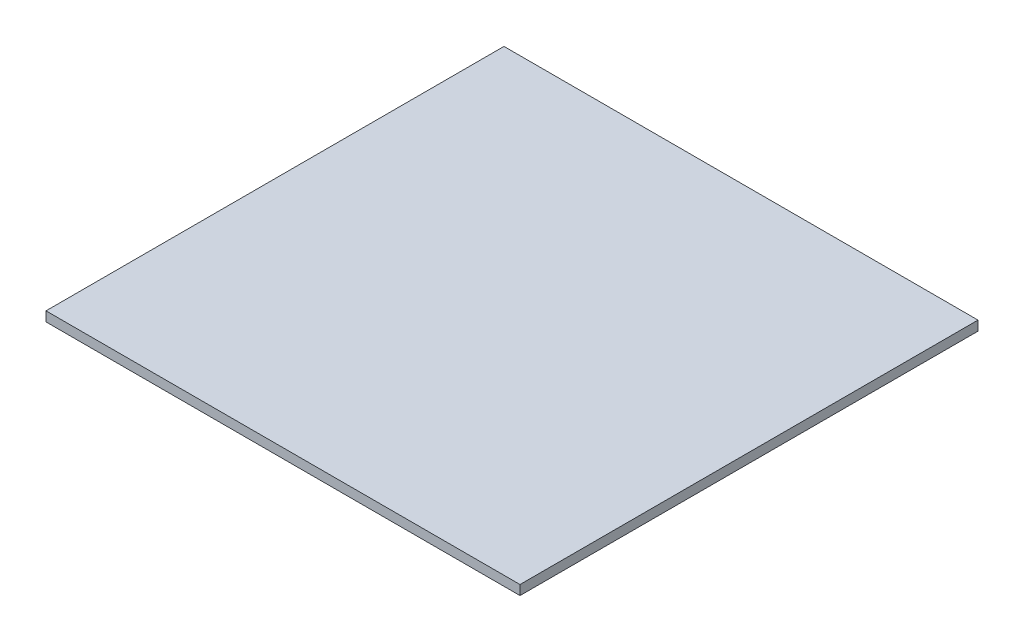
ISO-10303-21;
HEADER;
FILE_DESCRIPTION(('STEP AP214'),'2;1');
FILE_NAME('part.step','',(''),(''),'','','');
FILE_SCHEMA(('AUTOMOTIVE_DESIGN { 1 0 10303 214 1 1 1 1 }'));
ENDSEC;
DATA;
#1=APPLICATION_CONTEXT('core data for automotive mechanical design processes');
#2=APPLICATION_PROTOCOL_DEFINITION('international standard','automotive_design',2000,#1);
#3=PRODUCT_CONTEXT('',#1,'mechanical');
#4=PRODUCT('Part','Part','',(#3));
#5=PRODUCT_RELATED_PRODUCT_CATEGORY('part','',(#4));
#6=PRODUCT_DEFINITION_FORMATION('','',#4);
#7=PRODUCT_DEFINITION_CONTEXT('part definition',#1,'design');
#8=PRODUCT_DEFINITION('design','',#6,#7);
#9=PRODUCT_DEFINITION_SHAPE('','',#8);
#10=(LENGTH_UNIT() NAMED_UNIT(*) SI_UNIT(.MILLI.,.METRE.));
#11=(NAMED_UNIT(*) PLANE_ANGLE_UNIT() SI_UNIT($,.RADIAN.));
#12=(NAMED_UNIT(*) SI_UNIT($,.STERADIAN.) SOLID_ANGLE_UNIT());
#13=UNCERTAINTY_MEASURE_WITH_UNIT(LENGTH_MEASURE(1.E-05),#10,'distance_accuracy_value','');
#14=(GEOMETRIC_REPRESENTATION_CONTEXT(3) GLOBAL_UNCERTAINTY_ASSIGNED_CONTEXT((#13)) GLOBAL_UNIT_ASSIGNED_CONTEXT((#10,
#11,#12)) REPRESENTATION_CONTEXT('',''));
#15=CARTESIAN_POINT('',(0.,0.,0.));
#16=DIRECTION('',(0.,0.,1.));
#17=DIRECTION('',(1.,0.,0.));
#18=AXIS2_PLACEMENT_3D('',#15,#16,#17);
#19=CARTESIAN_POINT('',(469.9,19.05,454.025));
#20=DIRECTION('',(-1.,0.,0.));
#21=DIRECTION('',(0.,0.,1.));
#22=AXIS2_PLACEMENT_3D('',#19,#20,#21);
#23=PLANE('',#22);
#24=DIRECTION('',(0.,0.,-1.));
#25=VECTOR('',#24,1.);
#26=CARTESIAN_POINT('',(469.9,0.,454.025));
#27=LINE('',#26,#25);
#28=CARTESIAN_POINT('',(469.9,0.,454.025));
#29=VERTEX_POINT('',#28);
#30=CARTESIAN_POINT('',(469.9,0.,-454.025));
#31=VERTEX_POINT('',#30);
#32=EDGE_CURVE('E98',#29,#31,#27,.T.);
#33=ORIENTED_EDGE('',*,*,#32,.T.);
#34=DIRECTION('',(0.,-1.,0.));
#35=VECTOR('',#34,1.);
#36=CARTESIAN_POINT('',(469.9,19.05,-454.025));
#37=LINE('',#36,#35);
#38=CARTESIAN_POINT('',(469.9,19.05,-454.025));
#39=VERTEX_POINT('',#38);
#40=EDGE_CURVE('E11',#39,#31,#37,.T.);
#41=ORIENTED_EDGE('',*,*,#40,.F.);
#42=DIRECTION('',(0.,0.,-1.));
#43=VECTOR('',#42,1.);
#44=CARTESIAN_POINT('',(469.9,19.05,454.025));
#45=LINE('',#44,#43);
#46=CARTESIAN_POINT('',(469.9,19.05,454.025));
#47=VERTEX_POINT('',#46);
#48=EDGE_CURVE('E86',#47,#39,#45,.T.);
#49=ORIENTED_EDGE('',*,*,#48,.F.);
#50=DIRECTION('',(0.,-1.,0.));
#51=VECTOR('',#50,1.);
#52=CARTESIAN_POINT('',(469.9,19.05,454.025));
#53=LINE('',#52,#51);
#54=EDGE_CURVE('E94',#47,#29,#53,.T.);
#55=ORIENTED_EDGE('',*,*,#54,.T.);
#56=EDGE_LOOP('',(#33,#41,#49,#55));
#57=FACE_BOUND('',#56,.T.);
#58=ADVANCED_FACE('F35',(#57),#23,.F.);
#59=CARTESIAN_POINT('',(-469.9,19.05,-454.025));
#60=DIRECTION('',(0.,0.,1.));
#61=DIRECTION('',(1.,0.,0.));
#62=AXIS2_PLACEMENT_3D('',#59,#60,#61);
#63=PLANE('',#62);
#64=DIRECTION('',(-1.,0.,0.));
#65=VECTOR('',#64,1.);
#66=CARTESIAN_POINT('',(-469.9,0.,-454.025));
#67=LINE('',#66,#65);
#68=CARTESIAN_POINT('',(-469.9,0.,-454.025));
#69=VERTEX_POINT('',#68);
#70=EDGE_CURVE('E90',#31,#69,#67,.T.);
#71=ORIENTED_EDGE('',*,*,#70,.T.);
#72=DIRECTION('',(0.,-1.,0.));
#73=VECTOR('',#72,1.);
#74=CARTESIAN_POINT('',(-469.9,19.05,-454.025));
#75=LINE('',#74,#73);
#76=CARTESIAN_POINT('',(-469.9,19.05,-454.025));
#77=VERTEX_POINT('',#76);
#78=EDGE_CURVE('E43',#77,#69,#75,.T.);
#79=ORIENTED_EDGE('',*,*,#78,.F.);
#80=DIRECTION('',(-1.,0.,0.));
#81=VECTOR('',#80,1.);
#82=CARTESIAN_POINT('',(-469.9,19.05,-454.025));
#83=LINE('',#82,#81);
#84=EDGE_CURVE('E81',#39,#77,#83,.T.);
#85=ORIENTED_EDGE('',*,*,#84,.F.);
#86=ORIENTED_EDGE('',*,*,#40,.T.);
#87=EDGE_LOOP('',(#71,#79,#85,#86));
#88=FACE_BOUND('',#87,.T.);
#89=ADVANCED_FACE('F89',(#88),#63,.F.);
#90=CARTESIAN_POINT('',(-469.9,19.05,454.025));
#91=DIRECTION('',(1.,0.,0.));
#92=DIRECTION('',(0.,0.,-1.));
#93=AXIS2_PLACEMENT_3D('',#90,#91,#92);
#94=PLANE('',#93);
#95=DIRECTION('',(0.,0.,1.));
#96=VECTOR('',#95,1.);
#97=CARTESIAN_POINT('',(-469.9,0.,454.025));
#98=LINE('',#97,#96);
#99=CARTESIAN_POINT('',(-469.9,0.,454.025));
#100=VERTEX_POINT('',#99);
#101=EDGE_CURVE('E68',#69,#100,#98,.T.);
#102=ORIENTED_EDGE('',*,*,#101,.T.);
#103=DIRECTION('',(0.,-1.,0.));
#104=VECTOR('',#103,1.);
#105=CARTESIAN_POINT('',(-469.9,19.05,454.025));
#106=LINE('',#105,#104);
#107=CARTESIAN_POINT('',(-469.9,19.05,454.025));
#108=VERTEX_POINT('',#107);
#109=EDGE_CURVE('E91',#108,#100,#106,.T.);
#110=ORIENTED_EDGE('',*,*,#109,.F.);
#111=DIRECTION('',(0.,0.,1.));
#112=VECTOR('',#111,1.);
#113=CARTESIAN_POINT('',(-469.9,19.05,454.025));
#114=LINE('',#113,#112);
#115=EDGE_CURVE('E84',#77,#108,#114,.T.);
#116=ORIENTED_EDGE('',*,*,#115,.F.);
#117=ORIENTED_EDGE('',*,*,#78,.T.);
#118=EDGE_LOOP('',(#102,#110,#116,#117));
#119=FACE_BOUND('',#118,.T.);
#120=ADVANCED_FACE('F92',(#119),#94,.F.);
#121=CARTESIAN_POINT('',(-469.9,19.05,454.025));
#122=DIRECTION('',(0.,0.,-1.));
#123=DIRECTION('',(-1.,0.,0.));
#124=AXIS2_PLACEMENT_3D('',#121,#122,#123);
#125=PLANE('',#124);
#126=DIRECTION('',(1.,0.,0.));
#127=VECTOR('',#126,1.);
#128=CARTESIAN_POINT('',(-469.9,0.,454.025));
#129=LINE('',#128,#127);
#130=EDGE_CURVE('E74',#100,#29,#129,.T.);
#131=ORIENTED_EDGE('',*,*,#130,.T.);
#132=ORIENTED_EDGE('',*,*,#54,.F.);
#133=DIRECTION('',(1.,0.,0.));
#134=VECTOR('',#133,1.);
#135=CARTESIAN_POINT('',(-469.9,19.05,454.025));
#136=LINE('',#135,#134);
#137=EDGE_CURVE('E51',#108,#47,#136,.T.);
#138=ORIENTED_EDGE('',*,*,#137,.F.);
#139=ORIENTED_EDGE('',*,*,#109,.T.);
#140=EDGE_LOOP('',(#131,#132,#138,#139));
#141=FACE_BOUND('',#140,.T.);
#142=ADVANCED_FACE('F105',(#141),#125,.F.);
#143=CARTESIAN_POINT('',(0.,19.05,0.));
#144=DIRECTION('',(0.,-1.,0.));
#145=DIRECTION('',(0.,0.,-1.));
#146=AXIS2_PLACEMENT_3D('',#143,#144,#145);
#147=PLANE('',#146);
#148=ORIENTED_EDGE('',*,*,#48,.T.);
#149=ORIENTED_EDGE('',*,*,#84,.T.);
#150=ORIENTED_EDGE('',*,*,#115,.T.);
#151=ORIENTED_EDGE('',*,*,#137,.T.);
#152=EDGE_LOOP('',(#148,#149,#150,#151));
#153=FACE_BOUND('',#152,.T.);
#154=ADVANCED_FACE('F82',(#153),#147,.F.);
#155=CARTESIAN_POINT('',(0.,0.,0.));
#156=DIRECTION('',(0.,-1.,0.));
#157=DIRECTION('',(0.,0.,-1.));
#158=AXIS2_PLACEMENT_3D('',#155,#156,#157);
#159=PLANE('',#158);
#160=ORIENTED_EDGE('',*,*,#32,.F.);
#161=ORIENTED_EDGE('',*,*,#130,.F.);
#162=ORIENTED_EDGE('',*,*,#101,.F.);
#163=ORIENTED_EDGE('',*,*,#70,.F.);
#164=EDGE_LOOP('',(#160,#161,#162,#163));
#165=FACE_BOUND('',#164,.T.);
#166=ADVANCED_FACE('F108',(#165),#159,.T.);
#167=CLOSED_SHELL('',(#58,#89,#120,#142,#154,#166));
#168=MANIFOLD_SOLID_BREP('B2',#167);
#169=ADVANCED_BREP_SHAPE_REPRESENTATION('',(#18,#168),#14);
#170=SHAPE_DEFINITION_REPRESENTATION(#9,#169);
ENDSEC;
END-ISO-10303-21;
